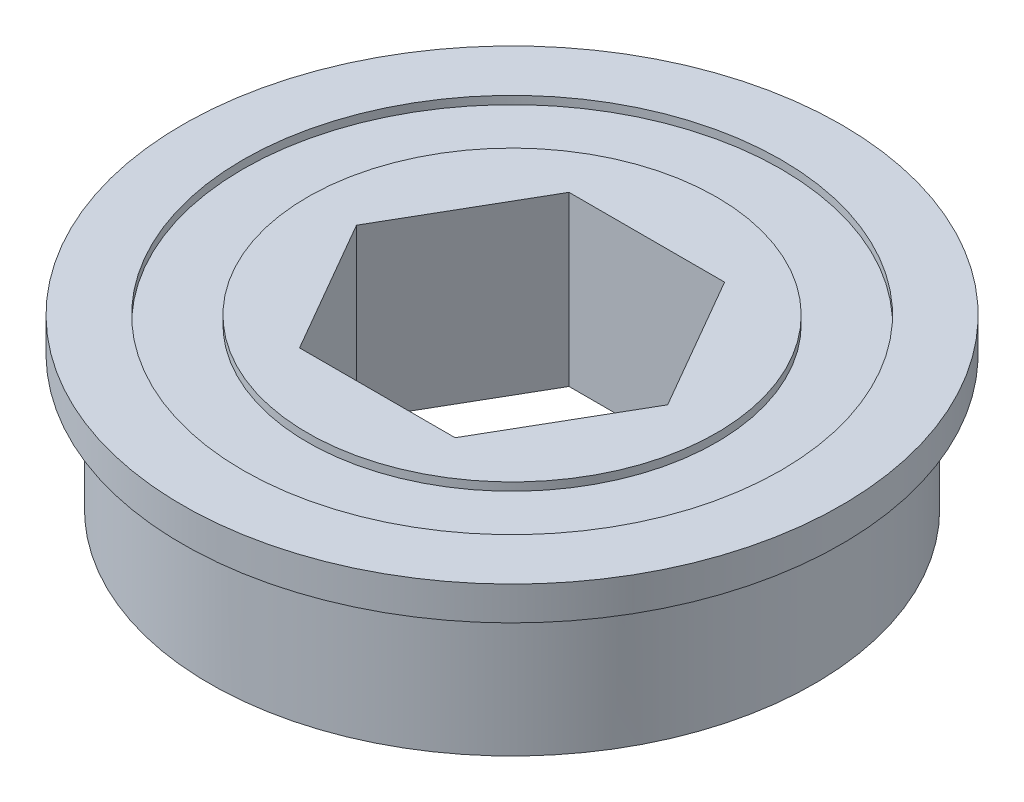
ISO-10303-21;
HEADER;
FILE_DESCRIPTION(('STEP AP214'),'2;1');
FILE_NAME('part.step','',(''),(''),'','','');
FILE_SCHEMA(('AUTOMOTIVE_DESIGN { 1 0 10303 214 1 1 1 1 }'));
ENDSEC;
DATA;
#1=APPLICATION_CONTEXT('core data for automotive mechanical design processes');
#2=APPLICATION_PROTOCOL_DEFINITION('international standard','automotive_design',2000,#1);
#3=PRODUCT_CONTEXT('',#1,'mechanical');
#4=PRODUCT('Part','Part','',(#3));
#5=PRODUCT_RELATED_PRODUCT_CATEGORY('part','',(#4));
#6=PRODUCT_DEFINITION_FORMATION('','',#4);
#7=PRODUCT_DEFINITION_CONTEXT('part definition',#1,'design');
#8=PRODUCT_DEFINITION('design','',#6,#7);
#9=PRODUCT_DEFINITION_SHAPE('','',#8);
#10=(LENGTH_UNIT() NAMED_UNIT(*) SI_UNIT(.MILLI.,.METRE.));
#11=(NAMED_UNIT(*) PLANE_ANGLE_UNIT() SI_UNIT($,.RADIAN.));
#12=(NAMED_UNIT(*) SI_UNIT($,.STERADIAN.) SOLID_ANGLE_UNIT());
#13=UNCERTAINTY_MEASURE_WITH_UNIT(LENGTH_MEASURE(1.E-05),#10,'distance_accuracy_value','');
#14=(GEOMETRIC_REPRESENTATION_CONTEXT(3) GLOBAL_UNCERTAINTY_ASSIGNED_CONTEXT((#13)) GLOBAL_UNIT_ASSIGNED_CONTEXT((#10,
#11,#12)) REPRESENTATION_CONTEXT('',''));
#15=CARTESIAN_POINT('',(0.,0.,0.));
#16=DIRECTION('',(0.,0.,1.));
#17=DIRECTION('',(1.,0.,0.));
#18=AXIS2_PLACEMENT_3D('',#15,#16,#17);
#19=CARTESIAN_POINT('',(3.67194771204602,0.,-6.36));
#20=DIRECTION('',(0.,0.,-1.));
#21=DIRECTION('',(-1.,0.,0.));
#22=AXIS2_PLACEMENT_3D('',#19,#20,#21);
#23=PLANE('',#22);
#24=DIRECTION('',(-1.,0.,0.));
#25=VECTOR('',#24,1.);
#26=CARTESIAN_POINT('',(3.67194771204602,7.9375,-6.36));
#27=LINE('',#26,#25);
#28=CARTESIAN_POINT('',(3.67194771204602,7.9375,-6.36));
#29=VERTEX_POINT('',#28);
#30=CARTESIAN_POINT('',(-3.67194771204602,7.9375,-6.36));
#31=VERTEX_POINT('',#30);
#32=EDGE_CURVE('E183',#29,#31,#27,.T.);
#33=ORIENTED_EDGE('',*,*,#32,.T.);
#34=DIRECTION('',(0.,1.,0.));
#35=VECTOR('',#34,1.);
#36=CARTESIAN_POINT('',(-3.67194771204602,0.,-6.36));
#37=LINE('',#36,#35);
#38=CARTESIAN_POINT('',(-3.67194771204602,0.,-6.36));
#39=VERTEX_POINT('',#38);
#40=EDGE_CURVE('E11',#39,#31,#37,.T.);
#41=ORIENTED_EDGE('',*,*,#40,.F.);
#42=DIRECTION('',(-1.,0.,0.));
#43=VECTOR('',#42,1.);
#44=CARTESIAN_POINT('',(3.67194771204602,0.,-6.36));
#45=LINE('',#44,#43);
#46=CARTESIAN_POINT('',(3.67194771204602,0.,-6.36));
#47=VERTEX_POINT('',#46);
#48=EDGE_CURVE('E247',#47,#39,#45,.T.);
#49=ORIENTED_EDGE('',*,*,#48,.F.);
#50=DIRECTION('',(0.,1.,0.));
#51=VECTOR('',#50,1.);
#52=CARTESIAN_POINT('',(3.67194771204602,0.,-6.36));
#53=LINE('',#52,#51);
#54=EDGE_CURVE('E250',#47,#29,#53,.T.);
#55=ORIENTED_EDGE('',*,*,#54,.T.);
#56=EDGE_LOOP('',(#33,#41,#49,#55));
#57=FACE_BOUND('',#56,.T.);
#58=ADVANCED_FACE('F17',(#57),#23,.F.);
#59=CARTESIAN_POINT('',(-3.67194771204602,0.,-6.36));
#60=DIRECTION('',(-0.866025403784439,0.,-0.5));
#61=DIRECTION('',(-0.5,0.,0.866025403784439));
#62=AXIS2_PLACEMENT_3D('',#59,#60,#61);
#63=PLANE('',#62);
#64=DIRECTION('',(-0.5,0.,0.866025403784439));
#65=VECTOR('',#64,1.);
#66=CARTESIAN_POINT('',(-3.67194771204602,7.9375,-6.36));
#67=LINE('',#66,#65);
#68=CARTESIAN_POINT('',(-7.34389542409204,7.9375,0.));
#69=VERTEX_POINT('',#68);
#70=EDGE_CURVE('E182',#31,#69,#67,.T.);
#71=ORIENTED_EDGE('',*,*,#70,.T.);
#72=DIRECTION('',(0.,1.,0.));
#73=VECTOR('',#72,1.);
#74=CARTESIAN_POINT('',(-7.34389542409204,0.,0.));
#75=LINE('',#74,#73);
#76=CARTESIAN_POINT('',(-7.34389542409204,0.,0.));
#77=VERTEX_POINT('',#76);
#78=EDGE_CURVE('E20',#77,#69,#75,.T.);
#79=ORIENTED_EDGE('',*,*,#78,.F.);
#80=DIRECTION('',(-0.5,0.,0.866025403784439));
#81=VECTOR('',#80,1.);
#82=CARTESIAN_POINT('',(-3.67194771204602,0.,-6.36));
#83=LINE('',#82,#81);
#84=EDGE_CURVE('E254',#39,#77,#83,.T.);
#85=ORIENTED_EDGE('',*,*,#84,.F.);
#86=ORIENTED_EDGE('',*,*,#40,.T.);
#87=EDGE_LOOP('',(#71,#79,#85,#86));
#88=FACE_BOUND('',#87,.T.);
#89=ADVANCED_FACE('F376',(#88),#63,.F.);
#90=CARTESIAN_POINT('',(-7.34389542409204,0.,0.));
#91=DIRECTION('',(-0.866025403784439,0.,0.5));
#92=DIRECTION('',(0.,1.,0.));
#93=AXIS2_PLACEMENT_3D('',#90,#91,#92);
#94=PLANE('',#93);
#95=DIRECTION('',(0.5,0.,0.866025403784439));
#96=VECTOR('',#95,1.);
#97=CARTESIAN_POINT('',(-7.34389542409204,7.9375,0.));
#98=LINE('',#97,#96);
#99=CARTESIAN_POINT('',(-3.67194771204601,7.9375,6.36));
#100=VERTEX_POINT('',#99);
#101=EDGE_CURVE('E184',#69,#100,#98,.T.);
#102=ORIENTED_EDGE('',*,*,#101,.T.);
#103=DIRECTION('',(0.,1.,0.));
#104=VECTOR('',#103,1.);
#105=CARTESIAN_POINT('',(-3.67194771204601,0.,6.36));
#106=LINE('',#105,#104);
#107=CARTESIAN_POINT('',(-3.67194771204601,0.,6.36));
#108=VERTEX_POINT('',#107);
#109=EDGE_CURVE('E291',#108,#100,#106,.T.);
#110=ORIENTED_EDGE('',*,*,#109,.F.);
#111=DIRECTION('',(0.5,0.,0.866025403784439));
#112=VECTOR('',#111,1.);
#113=CARTESIAN_POINT('',(-7.34389542409204,0.,0.));
#114=LINE('',#113,#112);
#115=EDGE_CURVE('E258',#77,#108,#114,.T.);
#116=ORIENTED_EDGE('',*,*,#115,.F.);
#117=ORIENTED_EDGE('',*,*,#78,.T.);
#118=EDGE_LOOP('',(#102,#110,#116,#117));
#119=FACE_BOUND('',#118,.T.);
#120=ADVANCED_FACE('F380',(#119),#94,.F.);
#121=CARTESIAN_POINT('',(-3.67194771204601,0.,6.36));
#122=DIRECTION('',(0.,0.,1.));
#123=DIRECTION('',(1.,0.,0.));
#124=AXIS2_PLACEMENT_3D('',#121,#122,#123);
#125=PLANE('',#124);
#126=DIRECTION('',(1.,0.,0.));
#127=VECTOR('',#126,1.);
#128=CARTESIAN_POINT('',(-3.67194771204601,7.9375,6.36));
#129=LINE('',#128,#127);
#130=CARTESIAN_POINT('',(3.67194771204602,7.9375,6.36));
#131=VERTEX_POINT('',#130);
#132=EDGE_CURVE('E278',#100,#131,#129,.T.);
#133=ORIENTED_EDGE('',*,*,#132,.T.);
#134=DIRECTION('',(0.,1.,0.));
#135=VECTOR('',#134,1.);
#136=CARTESIAN_POINT('',(3.67194771204602,0.,6.36));
#137=LINE('',#136,#135);
#138=CARTESIAN_POINT('',(3.67194771204602,0.,6.36));
#139=VERTEX_POINT('',#138);
#140=EDGE_CURVE('E289',#139,#131,#137,.T.);
#141=ORIENTED_EDGE('',*,*,#140,.F.);
#142=DIRECTION('',(1.,0.,0.));
#143=VECTOR('',#142,1.);
#144=CARTESIAN_POINT('',(-3.67194771204601,0.,6.36));
#145=LINE('',#144,#143);
#146=EDGE_CURVE('E262',#108,#139,#145,.T.);
#147=ORIENTED_EDGE('',*,*,#146,.F.);
#148=ORIENTED_EDGE('',*,*,#109,.T.);
#149=EDGE_LOOP('',(#133,#141,#147,#148));
#150=FACE_BOUND('',#149,.T.);
#151=ADVANCED_FACE('F440',(#150),#125,.F.);
#152=CARTESIAN_POINT('',(3.67194771204602,0.,6.36));
#153=DIRECTION('',(0.866025403784439,0.,0.5));
#154=DIRECTION('',(0.,-1.,0.));
#155=AXIS2_PLACEMENT_3D('',#152,#153,#154);
#156=PLANE('',#155);
#157=DIRECTION('',(0.5,0.,-0.866025403784439));
#158=VECTOR('',#157,1.);
#159=CARTESIAN_POINT('',(3.67194771204602,7.9375,6.36));
#160=LINE('',#159,#158);
#161=CARTESIAN_POINT('',(7.34389542409204,7.9375,0.));
#162=VERTEX_POINT('',#161);
#163=EDGE_CURVE('E274',#131,#162,#160,.T.);
#164=ORIENTED_EDGE('',*,*,#163,.T.);
#165=DIRECTION('',(0.,1.,0.));
#166=VECTOR('',#165,1.);
#167=CARTESIAN_POINT('',(7.34389542409204,0.,0.));
#168=LINE('',#167,#166);
#169=CARTESIAN_POINT('',(7.34389542409204,0.,0.));
#170=VERTEX_POINT('',#169);
#171=EDGE_CURVE('E286',#170,#162,#168,.T.);
#172=ORIENTED_EDGE('',*,*,#171,.F.);
#173=DIRECTION('',(0.5,0.,-0.866025403784439));
#174=VECTOR('',#173,1.);
#175=CARTESIAN_POINT('',(3.67194771204602,0.,6.36));
#176=LINE('',#175,#174);
#177=EDGE_CURVE('E266',#139,#170,#176,.T.);
#178=ORIENTED_EDGE('',*,*,#177,.F.);
#179=ORIENTED_EDGE('',*,*,#140,.T.);
#180=EDGE_LOOP('',(#164,#172,#178,#179));
#181=FACE_BOUND('',#180,.T.);
#182=ADVANCED_FACE('F333',(#181),#156,.F.);
#183=CARTESIAN_POINT('',(7.34389542409204,0.,0.));
#184=DIRECTION('',(0.866025403784439,0.,-0.5));
#185=DIRECTION('',(0.,-1.,0.));
#186=AXIS2_PLACEMENT_3D('',#183,#184,#185);
#187=PLANE('',#186);
#188=DIRECTION('',(-0.5,0.,-0.866025403784439));
#189=VECTOR('',#188,1.);
#190=CARTESIAN_POINT('',(7.34389542409204,7.9375,0.));
#191=LINE('',#190,#189);
#192=EDGE_CURVE('E270',#162,#29,#191,.T.);
#193=ORIENTED_EDGE('',*,*,#192,.T.);
#194=ORIENTED_EDGE('',*,*,#54,.F.);
#195=DIRECTION('',(-0.5,0.,-0.866025403784439));
#196=VECTOR('',#195,1.);
#197=CARTESIAN_POINT('',(7.34389542409204,0.,0.));
#198=LINE('',#197,#196);
#199=EDGE_CURVE('E243',#170,#47,#198,.T.);
#200=ORIENTED_EDGE('',*,*,#199,.F.);
#201=ORIENTED_EDGE('',*,*,#171,.T.);
#202=EDGE_LOOP('',(#193,#194,#200,#201));
#203=FACE_BOUND('',#202,.T.);
#204=ADVANCED_FACE('F328',(#203),#187,.F.);
#205=CARTESIAN_POINT('',(6.35,7.9375,0.));
#206=DIRECTION('',(0.,1.,0.));
#207=DIRECTION('',(1.,0.,0.));
#208=AXIS2_PLACEMENT_3D('',#205,#206,#207);
#209=PLANE('',#208);
#210=ORIENTED_EDGE('',*,*,#192,.F.);
#211=ORIENTED_EDGE('',*,*,#163,.F.);
#212=ORIENTED_EDGE('',*,*,#132,.F.);
#213=ORIENTED_EDGE('',*,*,#101,.F.);
#214=ORIENTED_EDGE('',*,*,#70,.F.);
#215=ORIENTED_EDGE('',*,*,#32,.F.);
#216=EDGE_LOOP('',(#210,#211,#212,#213,#214,#215));
#217=FACE_BOUND('',#216,.T.);
#218=CARTESIAN_POINT('',(0.,7.9375,0.));
#219=DIRECTION('',(0.,1.,0.));
#220=DIRECTION('',(0.,0.,1.));
#221=AXIS2_PLACEMENT_3D('',#218,#219,#220);
#222=CIRCLE('',#221,9.652);
#223=CARTESIAN_POINT('',(0.,7.9375,-9.652));
#224=VERTEX_POINT('',#223);
#225=EDGE_CURVE('E232',#224,#224,#222,.T.);
#226=ORIENTED_EDGE('',*,*,#225,.T.);
#227=EDGE_LOOP('',(#226));
#228=FACE_BOUND('',#227,.T.);
#229=ADVANCED_FACE('F332',(#217,#228),#209,.T.);
#230=CARTESIAN_POINT('',(9.652,0.,0.));
#231=DIRECTION('',(0.,-1.,0.));
#232=DIRECTION('',(0.,0.,-1.));
#233=AXIS2_PLACEMENT_3D('',#230,#231,#232);
#234=PLANE('',#233);
#235=ORIENTED_EDGE('',*,*,#199,.T.);
#236=ORIENTED_EDGE('',*,*,#48,.T.);
#237=ORIENTED_EDGE('',*,*,#84,.T.);
#238=ORIENTED_EDGE('',*,*,#115,.T.);
#239=ORIENTED_EDGE('',*,*,#146,.T.);
#240=ORIENTED_EDGE('',*,*,#177,.T.);
#241=EDGE_LOOP('',(#235,#236,#237,#238,#239,#240));
#242=FACE_BOUND('',#241,.T.);
#243=CARTESIAN_POINT('',(0.,0.,0.));
#244=DIRECTION('',(0.,1.,0.));
#245=DIRECTION('',(0.,0.,1.));
#246=AXIS2_PLACEMENT_3D('',#243,#244,#245);
#247=CIRCLE('',#246,9.652);
#248=CARTESIAN_POINT('',(0.,0.,-9.652));
#249=VERTEX_POINT('',#248);
#250=EDGE_CURVE('E193',#249,#249,#247,.T.);
#251=ORIENTED_EDGE('',*,*,#250,.F.);
#252=EDGE_LOOP('',(#251));
#253=FACE_BOUND('',#252,.T.);
#254=ADVANCED_FACE('F400',(#242,#253),#234,.T.);
#255=CARTESIAN_POINT('',(9.652,0.381,0.));
#256=DIRECTION('',(0.,-1.,0.));
#257=DIRECTION('',(0.,0.,-1.));
#258=AXIS2_PLACEMENT_3D('',#255,#256,#257);
#259=PLANE('',#258);
#260=CARTESIAN_POINT('',(0.,0.381,0.));
#261=DIRECTION('',(0.,1.,0.));
#262=DIRECTION('',(0.,0.,1.));
#263=AXIS2_PLACEMENT_3D('',#260,#261,#262);
#264=CIRCLE('',#263,9.652);
#265=CARTESIAN_POINT('',(0.,0.381,-9.652));
#266=VERTEX_POINT('',#265);
#267=EDGE_CURVE('E168',#266,#266,#264,.T.);
#268=ORIENTED_EDGE('',*,*,#267,.T.);
#269=EDGE_LOOP('',(#268));
#270=FACE_BOUND('',#269,.T.);
#271=CARTESIAN_POINT('',(0.,0.381,0.));
#272=DIRECTION('',(0.,1.,0.));
#273=DIRECTION('',(0.,0.,1.));
#274=AXIS2_PLACEMENT_3D('',#271,#272,#273);
#275=CIRCLE('',#274,12.7);
#276=CARTESIAN_POINT('',(0.,0.381,-12.7));
#277=VERTEX_POINT('',#276);
#278=EDGE_CURVE('E207',#277,#277,#275,.T.);
#279=ORIENTED_EDGE('',*,*,#278,.F.);
#280=EDGE_LOOP('',(#279));
#281=FACE_BOUND('',#280,.T.);
#282=ADVANCED_FACE('F323',(#270,#281),#259,.T.);
#283=CARTESIAN_POINT('',(14.2748,0.,0.));
#284=DIRECTION('',(0.,-1.,0.));
#285=DIRECTION('',(0.,0.,-1.));
#286=AXIS2_PLACEMENT_3D('',#283,#284,#285);
#287=PLANE('',#286);
#288=CARTESIAN_POINT('',(0.,0.,0.));
#289=DIRECTION('',(0.,1.,0.));
#290=DIRECTION('',(0.,0.,1.));
#291=AXIS2_PLACEMENT_3D('',#288,#289,#290);
#292=CIRCLE('',#291,12.7);
#293=CARTESIAN_POINT('',(0.,0.,-12.7));
#294=VERTEX_POINT('',#293);
#295=EDGE_CURVE('E196',#294,#294,#292,.T.);
#296=ORIENTED_EDGE('',*,*,#295,.T.);
#297=EDGE_LOOP('',(#296));
#298=FACE_BOUND('',#297,.T.);
#299=CARTESIAN_POINT('',(0.,0.,0.));
#300=DIRECTION('',(0.,1.,0.));
#301=DIRECTION('',(0.,0.,1.));
#302=AXIS2_PLACEMENT_3D('',#299,#300,#301);
#303=CIRCLE('',#302,14.2748);
#304=CARTESIAN_POINT('',(0.,0.,-14.2748));
#305=VERTEX_POINT('',#304);
#306=EDGE_CURVE('E163',#305,#305,#303,.T.);
#307=ORIENTED_EDGE('',*,*,#306,.F.);
#308=EDGE_LOOP('',(#307));
#309=FACE_BOUND('',#308,.T.);
#310=ADVANCED_FACE('F318',(#298,#309),#287,.T.);
#311=CARTESIAN_POINT('',(15.5575,6.35,0.));
#312=DIRECTION('',(0.,-1.,0.));
#313=DIRECTION('',(0.,0.,-1.));
#314=AXIS2_PLACEMENT_3D('',#311,#312,#313);
#315=PLANE('',#314);
#316=CARTESIAN_POINT('',(0.,6.35,0.));
#317=DIRECTION('',(0.,1.,0.));
#318=DIRECTION('',(0.,0.,1.));
#319=AXIS2_PLACEMENT_3D('',#316,#317,#318);
#320=CIRCLE('',#319,14.2748);
#321=CARTESIAN_POINT('',(0.,6.35,-14.2748));
#322=VERTEX_POINT('',#321);
#323=EDGE_CURVE('E178',#322,#322,#320,.T.);
#324=ORIENTED_EDGE('',*,*,#323,.T.);
#325=EDGE_LOOP('',(#324));
#326=FACE_BOUND('',#325,.T.);
#327=CARTESIAN_POINT('',(0.,6.35,0.));
#328=DIRECTION('',(0.,1.,0.));
#329=DIRECTION('',(0.,0.,1.));
#330=AXIS2_PLACEMENT_3D('',#327,#328,#329);
#331=CIRCLE('',#330,15.5575);
#332=CARTESIAN_POINT('',(0.,6.35,-15.5575));
#333=VERTEX_POINT('',#332);
#334=EDGE_CURVE('E224',#333,#333,#331,.T.);
#335=ORIENTED_EDGE('',*,*,#334,.F.);
#336=EDGE_LOOP('',(#335));
#337=FACE_BOUND('',#336,.T.);
#338=ADVANCED_FACE('F322',(#326,#337),#315,.T.);
#339=CARTESIAN_POINT('',(12.7,7.9375,0.));
#340=DIRECTION('',(0.,1.,0.));
#341=DIRECTION('',(1.,0.,0.));
#342=AXIS2_PLACEMENT_3D('',#339,#340,#341);
#343=PLANE('',#342);
#344=CARTESIAN_POINT('',(0.,7.9375,0.));
#345=DIRECTION('',(0.,1.,0.));
#346=DIRECTION('',(0.,0.,1.));
#347=AXIS2_PLACEMENT_3D('',#344,#345,#346);
#348=CIRCLE('',#347,12.7);
#349=CARTESIAN_POINT('',(0.,7.9375,-12.7));
#350=VERTEX_POINT('',#349);
#351=EDGE_CURVE('E201',#350,#350,#348,.T.);
#352=ORIENTED_EDGE('',*,*,#351,.F.);
#353=EDGE_LOOP('',(#352));
#354=FACE_BOUND('',#353,.T.);
#355=CARTESIAN_POINT('',(0.,7.9375,0.));
#356=DIRECTION('',(0.,1.,0.));
#357=DIRECTION('',(0.,0.,1.));
#358=AXIS2_PLACEMENT_3D('',#355,#356,#357);
#359=CIRCLE('',#358,15.5575);
#360=CARTESIAN_POINT('',(0.,7.9375,-15.5575));
#361=VERTEX_POINT('',#360);
#362=EDGE_CURVE('E162',#361,#361,#359,.T.);
#363=ORIENTED_EDGE('',*,*,#362,.T.);
#364=EDGE_LOOP('',(#363));
#365=FACE_BOUND('',#364,.T.);
#366=ADVANCED_FACE('F363',(#354,#365),#343,.T.);
#367=CARTESIAN_POINT('',(9.652,7.5565,0.));
#368=DIRECTION('',(0.,1.,0.));
#369=DIRECTION('',(1.,0.,0.));
#370=AXIS2_PLACEMENT_3D('',#367,#368,#369);
#371=PLANE('',#370);
#372=CARTESIAN_POINT('',(0.,7.5565,0.));
#373=DIRECTION('',(0.,1.,0.));
#374=DIRECTION('',(0.,0.,1.));
#375=AXIS2_PLACEMENT_3D('',#372,#373,#374);
#376=CIRCLE('',#375,9.652);
#377=CARTESIAN_POINT('',(0.,7.5565,-9.652));
#378=VERTEX_POINT('',#377);
#379=EDGE_CURVE('E240',#378,#378,#376,.T.);
#380=ORIENTED_EDGE('',*,*,#379,.F.);
#381=EDGE_LOOP('',(#380));
#382=FACE_BOUND('',#381,.T.);
#383=CARTESIAN_POINT('',(0.,7.5565,0.));
#384=DIRECTION('',(0.,1.,0.));
#385=DIRECTION('',(0.,0.,1.));
#386=AXIS2_PLACEMENT_3D('',#383,#384,#385);
#387=CIRCLE('',#386,12.7);
#388=CARTESIAN_POINT('',(0.,7.5565,-12.7));
#389=VERTEX_POINT('',#388);
#390=EDGE_CURVE('E202',#389,#389,#387,.T.);
#391=ORIENTED_EDGE('',*,*,#390,.T.);
#392=EDGE_LOOP('',(#391));
#393=FACE_BOUND('',#392,.T.);
#394=ADVANCED_FACE('F371',(#382,#393),#371,.T.);
#395=CARTESIAN_POINT('',(0.,0.,0.));
#396=DIRECTION('',(0.,1.,0.));
#397=DIRECTION('',(0.,0.,1.));
#398=AXIS2_PLACEMENT_3D('',#395,#396,#397);
#399=CYLINDRICAL_SURFACE('',#398,9.652);
#400=ORIENTED_EDGE('',*,*,#225,.F.);
#401=DIRECTION('',(0.,-1.,0.));
#402=VECTOR('',#401,1.);
#403=CARTESIAN_POINT('',(0.,0.,-9.652));
#404=LINE('',#403,#402);
#405=EDGE_CURVE('E236',#224,#378,#404,.T.);
#406=ORIENTED_EDGE('',*,*,#405,.T.);
#407=ORIENTED_EDGE('',*,*,#379,.T.);
#408=ORIENTED_EDGE('',*,*,#405,.F.);
#409=EDGE_LOOP('',(#400,#406,#407,#408));
#410=FACE_BOUND('',#409,.T.);
#411=ADVANCED_FACE('F395',(#410),#399,.T.);
#412=CARTESIAN_POINT('',(0.,0.,0.));
#413=DIRECTION('',(0.,1.,0.));
#414=DIRECTION('',(0.,0.,1.));
#415=AXIS2_PLACEMENT_3D('',#412,#413,#414);
#416=CYLINDRICAL_SURFACE('',#415,12.7);
#417=ORIENTED_EDGE('',*,*,#390,.F.);
#418=DIRECTION('',(0.,1.,0.));
#419=VECTOR('',#418,1.);
#420=CARTESIAN_POINT('',(0.,0.,-12.7));
#421=LINE('',#420,#419);
#422=EDGE_CURVE('E197',#389,#350,#421,.T.);
#423=ORIENTED_EDGE('',*,*,#422,.T.);
#424=ORIENTED_EDGE('',*,*,#351,.T.);
#425=ORIENTED_EDGE('',*,*,#422,.F.);
#426=EDGE_LOOP('',(#417,#423,#424,#425));
#427=FACE_BOUND('',#426,.T.);
#428=ADVANCED_FACE('F387',(#427),#416,.F.);
#429=CARTESIAN_POINT('',(0.,0.,0.));
#430=DIRECTION('',(0.,1.,0.));
#431=DIRECTION('',(0.,0.,1.));
#432=AXIS2_PLACEMENT_3D('',#429,#430,#431);
#433=CYLINDRICAL_SURFACE('',#432,15.5575);
#434=ORIENTED_EDGE('',*,*,#362,.F.);
#435=DIRECTION('',(0.,-1.,0.));
#436=VECTOR('',#435,1.);
#437=CARTESIAN_POINT('',(0.,0.,-15.5575));
#438=LINE('',#437,#436);
#439=EDGE_CURVE('E214',#361,#333,#438,.T.);
#440=ORIENTED_EDGE('',*,*,#439,.T.);
#441=ORIENTED_EDGE('',*,*,#334,.T.);
#442=ORIENTED_EDGE('',*,*,#439,.F.);
#443=EDGE_LOOP('',(#434,#440,#441,#442));
#444=FACE_BOUND('',#443,.T.);
#445=ADVANCED_FACE('F356',(#444),#433,.T.);
#446=CARTESIAN_POINT('',(0.,5.975,0.));
#447=DIRECTION('',(0.,-1.,0.));
#448=DIRECTION('',(0.,0.,-1.));
#449=AXIS2_PLACEMENT_3D('',#446,#447,#448);
#450=CONICAL_SURFACE('',#449,14.0582936490539,0.523598775598298);
#451=CARTESIAN_POINT('',(0.,5.6,0.));
#452=DIRECTION('',(0.,1.,0.));
#453=DIRECTION('',(0.,0.,1.));
#454=AXIS2_PLACEMENT_3D('',#451,#452,#453);
#455=CIRCLE('',#454,14.2748);
#456=CARTESIAN_POINT('',(0.,5.6,14.2748));
#457=VERTEX_POINT('',#456);
#458=CARTESIAN_POINT('',(0.,5.6,-14.2748));
#459=VERTEX_POINT('',#458);
#460=EDGE_CURVE('E210',#457,#459,#455,.T.);
#461=ORIENTED_EDGE('',*,*,#460,.T.);
#462=CARTESIAN_POINT('',(0.,5.6,0.));
#463=DIRECTION('',(0.,1.,0.));
#464=DIRECTION('',(0.,0.,1.));
#465=AXIS2_PLACEMENT_3D('',#462,#463,#464);
#466=CIRCLE('',#465,14.2748);
#467=EDGE_CURVE('E159',#459,#457,#466,.T.);
#468=ORIENTED_EDGE('',*,*,#467,.T.);
#469=DIRECTION('',(0.,0.866025403784439,-0.5));
#470=VECTOR('',#469,1.);
#471=CARTESIAN_POINT('',(0.,5.975,14.0582936490539));
#472=LINE('',#471,#470);
#473=CARTESIAN_POINT('',(0.,5.975,14.0582936490539));
#474=VERTEX_POINT('',#473);
#475=EDGE_CURVE('E151',#457,#474,#472,.T.);
#476=ORIENTED_EDGE('',*,*,#475,.T.);
#477=CARTESIAN_POINT('',(0.,5.975,0.));
#478=DIRECTION('',(0.,1.,0.));
#479=DIRECTION('',(0.,0.,1.));
#480=AXIS2_PLACEMENT_3D('',#477,#478,#479);
#481=CIRCLE('',#480,14.0582936490539);
#482=CARTESIAN_POINT('',(0.,5.975,-14.0582936490539));
#483=VERTEX_POINT('',#482);
#484=EDGE_CURVE('E156',#483,#474,#481,.T.);
#485=ORIENTED_EDGE('',*,*,#484,.F.);
#486=CARTESIAN_POINT('',(0.,5.975,0.));
#487=DIRECTION('',(0.,1.,0.));
#488=DIRECTION('',(0.,0.,1.));
#489=AXIS2_PLACEMENT_3D('',#486,#487,#488);
#490=CIRCLE('',#489,14.0582936490539);
#491=EDGE_CURVE('E165',#474,#483,#490,.T.);
#492=ORIENTED_EDGE('',*,*,#491,.F.);
#493=ORIENTED_EDGE('',*,*,#475,.F.);
#494=EDGE_LOOP('',(#461,#468,#476,#485,#492,#493));
#495=FACE_BOUND('',#494,.T.);
#496=ADVANCED_FACE('F154',(#495),#450,.T.);
#497=CARTESIAN_POINT('',(0.,0.,0.));
#498=DIRECTION('',(0.,1.,0.));
#499=DIRECTION('',(0.,0.,1.));
#500=AXIS2_PLACEMENT_3D('',#497,#498,#499);
#501=CYLINDRICAL_SURFACE('',#500,14.2748);
#502=ORIENTED_EDGE('',*,*,#460,.F.);
#503=ORIENTED_EDGE('',*,*,#467,.F.);
#504=DIRECTION('',(0.,-1.,0.));
#505=VECTOR('',#504,1.);
#506=CARTESIAN_POINT('',(0.,0.,-14.2748));
#507=LINE('',#506,#505);
#508=EDGE_CURVE('E215',#459,#305,#507,.T.);
#509=ORIENTED_EDGE('',*,*,#508,.T.);
#510=ORIENTED_EDGE('',*,*,#306,.T.);
#511=ORIENTED_EDGE('',*,*,#508,.F.);
#512=EDGE_LOOP('',(#502,#503,#509,#510,#511));
#513=FACE_BOUND('',#512,.T.);
#514=ADVANCED_FACE('F341',(#513),#501,.T.);
#515=CARTESIAN_POINT('',(0.,0.,0.));
#516=DIRECTION('',(0.,1.,0.));
#517=DIRECTION('',(0.,0.,1.));
#518=AXIS2_PLACEMENT_3D('',#515,#516,#517);
#519=CYLINDRICAL_SURFACE('',#518,12.7);
#520=ORIENTED_EDGE('',*,*,#295,.F.);
#521=DIRECTION('',(0.,1.,0.));
#522=VECTOR('',#521,1.);
#523=CARTESIAN_POINT('',(0.,0.,-12.7));
#524=LINE('',#523,#522);
#525=EDGE_CURVE('E203',#294,#277,#524,.T.);
#526=ORIENTED_EDGE('',*,*,#525,.T.);
#527=ORIENTED_EDGE('',*,*,#278,.T.);
#528=ORIENTED_EDGE('',*,*,#525,.F.);
#529=EDGE_LOOP('',(#520,#526,#527,#528));
#530=FACE_BOUND('',#529,.T.);
#531=ADVANCED_FACE('F313',(#530),#519,.F.);
#532=CARTESIAN_POINT('',(0.,0.,0.));
#533=DIRECTION('',(0.,1.,0.));
#534=DIRECTION('',(0.,0.,1.));
#535=AXIS2_PLACEMENT_3D('',#532,#533,#534);
#536=CYLINDRICAL_SURFACE('',#535,9.652);
#537=ORIENTED_EDGE('',*,*,#267,.F.);
#538=DIRECTION('',(0.,-1.,0.));
#539=VECTOR('',#538,1.);
#540=CARTESIAN_POINT('',(0.,0.,-9.652));
#541=LINE('',#540,#539);
#542=EDGE_CURVE('E188',#266,#249,#541,.T.);
#543=ORIENTED_EDGE('',*,*,#542,.T.);
#544=ORIENTED_EDGE('',*,*,#250,.T.);
#545=ORIENTED_EDGE('',*,*,#542,.F.);
#546=EDGE_LOOP('',(#537,#543,#544,#545));
#547=FACE_BOUND('',#546,.T.);
#548=ADVANCED_FACE('F305',(#547),#536,.T.);
#549=CARTESIAN_POINT('',(0.,6.1,0.));
#550=DIRECTION('',(0.,1.,0.));
#551=DIRECTION('',(0.,0.,1.));
#552=AXIS2_PLACEMENT_3D('',#549,#550,#551);
#553=TOROIDAL_SURFACE('',#552,14.2748,0.25);
#554=ORIENTED_EDGE('',*,*,#323,.F.);
#555=CARTESIAN_POINT('',(0.,6.1,-14.2748));
#556=DIRECTION('',(1.,0.,0.));
#557=DIRECTION('',(0.,0.,-1.));
#558=AXIS2_PLACEMENT_3D('',#555,#556,#557);
#559=CIRCLE('',#558,0.25);
#560=EDGE_CURVE('E172',#322,#483,#559,.T.);
#561=ORIENTED_EDGE('',*,*,#560,.T.);
#562=ORIENTED_EDGE('',*,*,#484,.T.);
#563=ORIENTED_EDGE('',*,*,#491,.T.);
#564=ORIENTED_EDGE('',*,*,#560,.F.);
#565=EDGE_LOOP('',(#554,#561,#562,#563,#564));
#566=FACE_BOUND('',#565,.T.);
#567=ADVANCED_FACE('F171',(#566),#553,.F.);
#568=CLOSED_SHELL('',(#58,#89,#120,#151,#182,#204,#229,#254,#282,#310,#338,#366,#394,#411,#428,
#445,#496,#514,#531,#548,#567));
#569=MANIFOLD_SOLID_BREP('B1',#568);
#570=ADVANCED_BREP_SHAPE_REPRESENTATION('',(#18,#569),#14);
#571=SHAPE_DEFINITION_REPRESENTATION(#9,#570);
ENDSEC;
END-ISO-10303-21;
